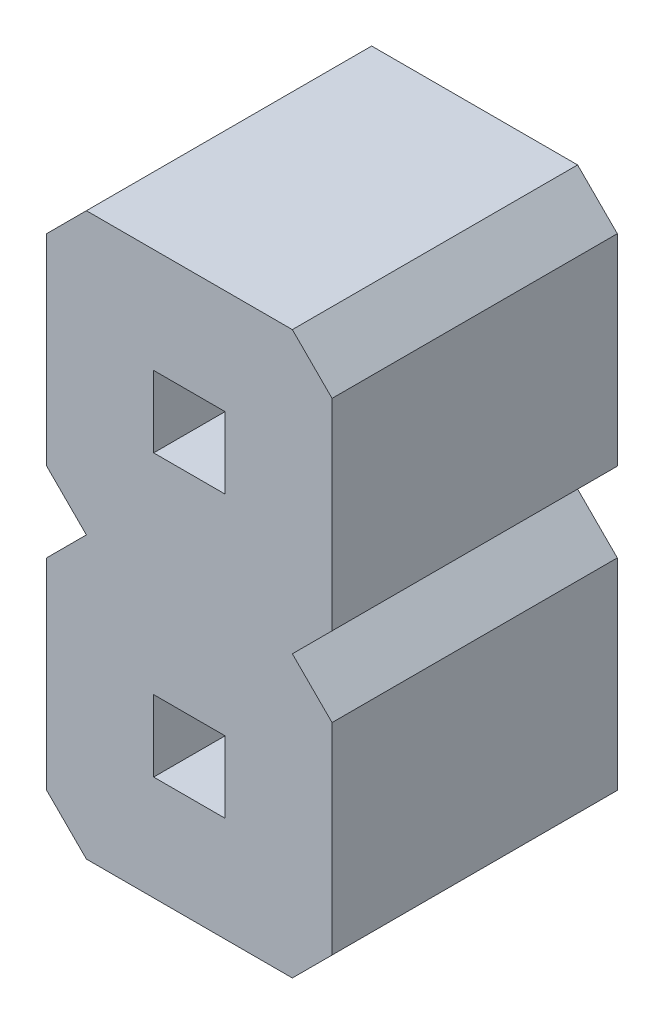
ISO-10303-21;
HEADER;
FILE_DESCRIPTION(('STEP AP214'),'2;1');
FILE_NAME('part.step','',(''),(''),'','','');
FILE_SCHEMA(('AUTOMOTIVE_DESIGN { 1 0 10303 214 1 1 1 1 }'));
ENDSEC;
DATA;
#1=APPLICATION_CONTEXT('core data for automotive mechanical design processes');
#2=APPLICATION_PROTOCOL_DEFINITION('international standard','automotive_design',2000,#1);
#3=PRODUCT_CONTEXT('',#1,'mechanical');
#4=PRODUCT('Part','Part','',(#3));
#5=PRODUCT_RELATED_PRODUCT_CATEGORY('part','',(#4));
#6=PRODUCT_DEFINITION_FORMATION('','',#4);
#7=PRODUCT_DEFINITION_CONTEXT('part definition',#1,'design');
#8=PRODUCT_DEFINITION('design','',#6,#7);
#9=PRODUCT_DEFINITION_SHAPE('','',#8);
#10=(LENGTH_UNIT() NAMED_UNIT(*) SI_UNIT(.MILLI.,.METRE.));
#11=(NAMED_UNIT(*) PLANE_ANGLE_UNIT() SI_UNIT($,.RADIAN.));
#12=(NAMED_UNIT(*) SI_UNIT($,.STERADIAN.) SOLID_ANGLE_UNIT());
#13=UNCERTAINTY_MEASURE_WITH_UNIT(LENGTH_MEASURE(1.E-05),#10,'distance_accuracy_value','');
#14=(GEOMETRIC_REPRESENTATION_CONTEXT(3) GLOBAL_UNCERTAINTY_ASSIGNED_CONTEXT((#13)) GLOBAL_UNIT_ASSIGNED_CONTEXT((#10,
#11,#12)) REPRESENTATION_CONTEXT('',''));
#15=CARTESIAN_POINT('',(0.,0.,0.));
#16=DIRECTION('',(0.,0.,1.));
#17=DIRECTION('',(1.,0.,0.));
#18=AXIS2_PLACEMENT_3D('',#15,#16,#17);
#19=CARTESIAN_POINT('',(0.,0.,2.54));
#20=DIRECTION('',(0.,0.,1.));
#21=DIRECTION('',(1.,0.,0.));
#22=AXIS2_PLACEMENT_3D('',#19,#20,#21);
#23=PLANE('',#22);
#24=DIRECTION('',(1.,0.,0.));
#25=VECTOR('',#24,1.);
#26=CARTESIAN_POINT('',(0.9525,-1.568,2.54));
#27=LINE('',#26,#25);
#28=CARTESIAN_POINT('',(0.9525,-1.568,2.54));
#29=VERTEX_POINT('',#28);
#30=CARTESIAN_POINT('',(1.5885,-1.568,2.54));
#31=VERTEX_POINT('',#30);
#32=EDGE_CURVE('E220',#29,#31,#27,.T.);
#33=ORIENTED_EDGE('',*,*,#32,.F.);
#34=DIRECTION('',(0.,-1.,0.));
#35=VECTOR('',#34,1.);
#36=CARTESIAN_POINT('',(0.9525,-0.932,2.54));
#37=LINE('',#36,#35);
#38=CARTESIAN_POINT('',(0.9525,-0.932,2.54));
#39=VERTEX_POINT('',#38);
#40=EDGE_CURVE('E218',#39,#29,#37,.T.);
#41=ORIENTED_EDGE('',*,*,#40,.F.);
#42=DIRECTION('',(-1.,0.,0.));
#43=VECTOR('',#42,1.);
#44=CARTESIAN_POINT('',(0.9525,-0.932,2.54));
#45=LINE('',#44,#43);
#46=CARTESIAN_POINT('',(1.5885,-0.932,2.54));
#47=VERTEX_POINT('',#46);
#48=EDGE_CURVE('E226',#47,#39,#45,.T.);
#49=ORIENTED_EDGE('',*,*,#48,.F.);
#50=DIRECTION('',(0.,1.,0.));
#51=VECTOR('',#50,1.);
#52=CARTESIAN_POINT('',(1.5885,-0.932,2.54));
#53=LINE('',#52,#51);
#54=EDGE_CURVE('E223',#31,#47,#53,.T.);
#55=ORIENTED_EDGE('',*,*,#54,.F.);
#56=EDGE_LOOP('',(#33,#41,#49,#55));
#57=FACE_BOUND('',#56,.T.);
#58=DIRECTION('',(-0.707106781186543,-0.707106781186552,0.));
#59=VECTOR('',#58,1.);
#60=CARTESIAN_POINT('',(0.,-0.353553390593276,2.54));
#61=LINE('',#60,#59);
#62=CARTESIAN_POINT('',(0.353553390593274,0.,2.54));
#63=VERTEX_POINT('',#62);
#64=CARTESIAN_POINT('',(0.,-0.353553390593276,2.54));
#65=VERTEX_POINT('',#64);
#66=EDGE_CURVE('E249',#63,#65,#61,.T.);
#67=ORIENTED_EDGE('',*,*,#66,.T.);
#68=DIRECTION('',(0.,-1.,0.));
#69=VECTOR('',#68,1.);
#70=CARTESIAN_POINT('',(0.,-0.353553390593276,2.54));
#71=LINE('',#70,#69);
#72=CARTESIAN_POINT('',(0.,-2.14644660940673,2.54));
#73=VERTEX_POINT('',#72);
#74=EDGE_CURVE('E252',#65,#73,#71,.T.);
#75=ORIENTED_EDGE('',*,*,#74,.T.);
#76=DIRECTION('',(0.707106781186551,-0.707106781186544,0.));
#77=VECTOR('',#76,1.);
#78=CARTESIAN_POINT('',(0.353553390593274,-2.5,2.54));
#79=LINE('',#78,#77);
#80=CARTESIAN_POINT('',(0.353553390593274,-2.5,2.54));
#81=VERTEX_POINT('',#80);
#82=EDGE_CURVE('E255',#73,#81,#79,.T.);
#83=ORIENTED_EDGE('',*,*,#82,.T.);
#84=DIRECTION('',(1.,0.,0.));
#85=VECTOR('',#84,1.);
#86=CARTESIAN_POINT('',(2.18744660940673,-2.50000000000001,2.54));
#87=LINE('',#86,#85);
#88=CARTESIAN_POINT('',(2.18744660940673,-2.50000000000001,2.54));
#89=VERTEX_POINT('',#88);
#90=EDGE_CURVE('E257',#81,#89,#87,.T.);
#91=ORIENTED_EDGE('',*,*,#90,.T.);
#92=DIRECTION('',(0.707106781186538,0.707106781186557,0.));
#93=VECTOR('',#92,1.);
#94=CARTESIAN_POINT('',(2.54100000000001,-2.14644660940673,2.54));
#95=LINE('',#94,#93);
#96=CARTESIAN_POINT('',(2.54100000000001,-2.14644660940673,2.54));
#97=VERTEX_POINT('',#96);
#98=EDGE_CURVE('E259',#89,#97,#95,.T.);
#99=ORIENTED_EDGE('',*,*,#98,.T.);
#100=DIRECTION('',(0.,1.,0.));
#101=VECTOR('',#100,1.);
#102=CARTESIAN_POINT('',(2.541,-0.353553390593266,2.54));
#103=LINE('',#102,#101);
#104=CARTESIAN_POINT('',(2.541,-0.353553390593266,2.54));
#105=VERTEX_POINT('',#104);
#106=EDGE_CURVE('E261',#97,#105,#103,.T.);
#107=ORIENTED_EDGE('',*,*,#106,.T.);
#108=DIRECTION('',(-0.707106781186556,0.707106781186539,0.));
#109=VECTOR('',#108,1.);
#110=CARTESIAN_POINT('',(2.18744660940671,0.,2.54));
#111=LINE('',#110,#109);
#112=CARTESIAN_POINT('',(2.18744660940671,0.,2.54));
#113=VERTEX_POINT('',#112);
#114=EDGE_CURVE('E263',#105,#113,#111,.T.);
#115=ORIENTED_EDGE('',*,*,#114,.T.);
#116=DIRECTION('',(0.707106781186562,0.707106781186533,0.));
#117=VECTOR('',#116,1.);
#118=CARTESIAN_POINT('',(2.54099999999999,0.353553390593273,2.54));
#119=LINE('',#118,#117);
#120=CARTESIAN_POINT('',(2.54099999999999,0.353553390593273,2.54));
#121=VERTEX_POINT('',#120);
#122=EDGE_CURVE('E265',#113,#121,#119,.T.);
#123=ORIENTED_EDGE('',*,*,#122,.T.);
#124=DIRECTION('',(0.,1.,0.));
#125=VECTOR('',#124,1.);
#126=CARTESIAN_POINT('',(2.54099999999999,2.14644660940673,2.54));
#127=LINE('',#126,#125);
#128=CARTESIAN_POINT('',(2.54099999999999,2.14644660940673,2.54));
#129=VERTEX_POINT('',#128);
#130=EDGE_CURVE('E267',#121,#129,#127,.T.);
#131=ORIENTED_EDGE('',*,*,#130,.T.);
#132=DIRECTION('',(-0.707106781186556,0.707106781186539,0.));
#133=VECTOR('',#132,1.);
#134=CARTESIAN_POINT('',(2.18744660940672,2.5,2.54));
#135=LINE('',#134,#133);
#136=CARTESIAN_POINT('',(2.18744660940672,2.5,2.54));
#137=VERTEX_POINT('',#136);
#138=EDGE_CURVE('E269',#129,#137,#135,.T.);
#139=ORIENTED_EDGE('',*,*,#138,.T.);
#140=DIRECTION('',(-1.,0.,0.));
#141=VECTOR('',#140,1.);
#142=CARTESIAN_POINT('',(0.353553390593263,2.5,2.54));
#143=LINE('',#142,#141);
#144=CARTESIAN_POINT('',(0.353553390593263,2.5,2.54));
#145=VERTEX_POINT('',#144);
#146=EDGE_CURVE('E271',#137,#145,#143,.T.);
#147=ORIENTED_EDGE('',*,*,#146,.T.);
#148=DIRECTION('',(-0.707106781186541,-0.707106781186554,0.));
#149=VECTOR('',#148,1.);
#150=CARTESIAN_POINT('',(0.,2.14644660940672,2.54));
#151=LINE('',#150,#149);
#152=CARTESIAN_POINT('',(0.,2.14644660940672,2.54));
#153=VERTEX_POINT('',#152);
#154=EDGE_CURVE('E273',#145,#153,#151,.T.);
#155=ORIENTED_EDGE('',*,*,#154,.T.);
#156=DIRECTION('',(0.,-1.,0.));
#157=VECTOR('',#156,1.);
#158=CARTESIAN_POINT('',(0.,2.14644660940672,2.54));
#159=LINE('',#158,#157);
#160=CARTESIAN_POINT('',(0.,0.35355339059327,2.54));
#161=VERTEX_POINT('',#160);
#162=EDGE_CURVE('E275',#153,#161,#159,.T.);
#163=ORIENTED_EDGE('',*,*,#162,.T.);
#164=DIRECTION('',(0.70710678118656,-0.707106781186535,0.));
#165=VECTOR('',#164,1.);
#166=CARTESIAN_POINT('',(0.353553390593274,0.,2.54));
#167=LINE('',#166,#165);
#168=EDGE_CURVE('E277',#161,#63,#167,.T.);
#169=ORIENTED_EDGE('',*,*,#168,.T.);
#170=EDGE_LOOP('',(#67,#75,#83,#91,#99,#107,#115,#123,#131,#139,#147,#155,#163,#169));
#171=FACE_BOUND('',#170,.T.);
#172=DIRECTION('',(1.,0.,0.));
#173=VECTOR('',#172,1.);
#174=CARTESIAN_POINT('',(0.952499999999992,0.932,2.54));
#175=LINE('',#174,#173);
#176=CARTESIAN_POINT('',(0.952499999999992,0.932,2.54));
#177=VERTEX_POINT('',#176);
#178=CARTESIAN_POINT('',(1.58849999999999,0.932,2.54));
#179=VERTEX_POINT('',#178);
#180=EDGE_CURVE('E190',#177,#179,#175,.T.);
#181=ORIENTED_EDGE('',*,*,#180,.F.);
#182=DIRECTION('',(0.,-1.,0.));
#183=VECTOR('',#182,1.);
#184=CARTESIAN_POINT('',(0.952499999999991,1.568,2.54));
#185=LINE('',#184,#183);
#186=CARTESIAN_POINT('',(0.952499999999991,1.568,2.54));
#187=VERTEX_POINT('',#186);
#188=EDGE_CURVE('E182',#187,#177,#185,.T.);
#189=ORIENTED_EDGE('',*,*,#188,.F.);
#190=DIRECTION('',(-1.,0.,0.));
#191=VECTOR('',#190,1.);
#192=CARTESIAN_POINT('',(0.952499999999991,1.568,2.54));
#193=LINE('',#192,#191);
#194=CARTESIAN_POINT('',(1.58849999999999,1.568,2.54));
#195=VERTEX_POINT('',#194);
#196=EDGE_CURVE('E204',#195,#187,#193,.T.);
#197=ORIENTED_EDGE('',*,*,#196,.F.);
#198=DIRECTION('',(0.,1.,0.));
#199=VECTOR('',#198,1.);
#200=CARTESIAN_POINT('',(1.58849999999999,1.568,2.54));
#201=LINE('',#200,#199);
#202=EDGE_CURVE('E202',#179,#195,#201,.T.);
#203=ORIENTED_EDGE('',*,*,#202,.F.);
#204=EDGE_LOOP('',(#181,#189,#197,#203));
#205=FACE_BOUND('',#204,.T.);
#206=ADVANCED_FACE('F33',(#57,#171,#205),#23,.T.);
#207=CARTESIAN_POINT('',(0.,0.,0.));
#208=DIRECTION('',(0.,0.,1.));
#209=DIRECTION('',(1.,0.,0.));
#210=AXIS2_PLACEMENT_3D('',#207,#208,#209);
#211=PLANE('',#210);
#212=DIRECTION('',(0.,-1.,0.));
#213=VECTOR('',#212,1.);
#214=CARTESIAN_POINT('',(0.9525,-0.932,0.));
#215=LINE('',#214,#213);
#216=CARTESIAN_POINT('',(0.9525,-0.932,0.));
#217=VERTEX_POINT('',#216);
#218=CARTESIAN_POINT('',(0.9525,-1.568,0.));
#219=VERTEX_POINT('',#218);
#220=EDGE_CURVE('E198',#217,#219,#215,.T.);
#221=ORIENTED_EDGE('',*,*,#220,.T.);
#222=DIRECTION('',(1.,0.,0.));
#223=VECTOR('',#222,1.);
#224=CARTESIAN_POINT('',(0.9525,-1.568,0.));
#225=LINE('',#224,#223);
#226=CARTESIAN_POINT('',(1.5885,-1.568,0.));
#227=VERTEX_POINT('',#226);
#228=EDGE_CURVE('E231',#219,#227,#225,.T.);
#229=ORIENTED_EDGE('',*,*,#228,.T.);
#230=DIRECTION('',(0.,1.,0.));
#231=VECTOR('',#230,1.);
#232=CARTESIAN_POINT('',(1.5885,-0.932,0.));
#233=LINE('',#232,#231);
#234=CARTESIAN_POINT('',(1.5885,-0.932,0.));
#235=VERTEX_POINT('',#234);
#236=EDGE_CURVE('E234',#227,#235,#233,.T.);
#237=ORIENTED_EDGE('',*,*,#236,.T.);
#238=DIRECTION('',(-1.,0.,0.));
#239=VECTOR('',#238,1.);
#240=CARTESIAN_POINT('',(0.9525,-0.932,0.));
#241=LINE('',#240,#239);
#242=EDGE_CURVE('E221',#235,#217,#241,.T.);
#243=ORIENTED_EDGE('',*,*,#242,.T.);
#244=EDGE_LOOP('',(#221,#229,#237,#243));
#245=FACE_BOUND('',#244,.T.);
#246=DIRECTION('',(-0.707106781186543,-0.707106781186552,0.));
#247=VECTOR('',#246,1.);
#248=CARTESIAN_POINT('',(0.,-0.353553390593276,0.));
#249=LINE('',#248,#247);
#250=CARTESIAN_POINT('',(0.353553390593274,0.,0.));
#251=VERTEX_POINT('',#250);
#252=CARTESIAN_POINT('',(0.,-0.353553390593276,0.));
#253=VERTEX_POINT('',#252);
#254=EDGE_CURVE('E248',#251,#253,#249,.T.);
#255=ORIENTED_EDGE('',*,*,#254,.F.);
#256=DIRECTION('',(0.70710678118656,-0.707106781186535,0.));
#257=VECTOR('',#256,1.);
#258=CARTESIAN_POINT('',(0.353553390593274,0.,0.));
#259=LINE('',#258,#257);
#260=CARTESIAN_POINT('',(0.,0.35355339059327,0.));
#261=VERTEX_POINT('',#260);
#262=EDGE_CURVE('E253',#261,#251,#259,.T.);
#263=ORIENTED_EDGE('',*,*,#262,.F.);
#264=DIRECTION('',(0.,-1.,0.));
#265=VECTOR('',#264,1.);
#266=CARTESIAN_POINT('',(0.,2.14644660940672,0.));
#267=LINE('',#266,#265);
#268=CARTESIAN_POINT('',(0.,2.14644660940672,0.));
#269=VERTEX_POINT('',#268);
#270=EDGE_CURVE('E304',#269,#261,#267,.T.);
#271=ORIENTED_EDGE('',*,*,#270,.F.);
#272=DIRECTION('',(-0.707106781186541,-0.707106781186554,0.));
#273=VECTOR('',#272,1.);
#274=CARTESIAN_POINT('',(0.,2.14644660940672,0.));
#275=LINE('',#274,#273);
#276=CARTESIAN_POINT('',(0.353553390593263,2.5,0.));
#277=VERTEX_POINT('',#276);
#278=EDGE_CURVE('E302',#277,#269,#275,.T.);
#279=ORIENTED_EDGE('',*,*,#278,.F.);
#280=DIRECTION('',(-1.,0.,0.));
#281=VECTOR('',#280,1.);
#282=CARTESIAN_POINT('',(0.353553390593263,2.5,0.));
#283=LINE('',#282,#281);
#284=CARTESIAN_POINT('',(2.18744660940672,2.5,0.));
#285=VERTEX_POINT('',#284);
#286=EDGE_CURVE('E300',#285,#277,#283,.T.);
#287=ORIENTED_EDGE('',*,*,#286,.F.);
#288=DIRECTION('',(-0.707106781186556,0.707106781186539,0.));
#289=VECTOR('',#288,1.);
#290=CARTESIAN_POINT('',(2.18744660940672,2.5,0.));
#291=LINE('',#290,#289);
#292=CARTESIAN_POINT('',(2.54099999999999,2.14644660940673,0.));
#293=VERTEX_POINT('',#292);
#294=EDGE_CURVE('E298',#293,#285,#291,.T.);
#295=ORIENTED_EDGE('',*,*,#294,.F.);
#296=DIRECTION('',(0.,1.,0.));
#297=VECTOR('',#296,1.);
#298=CARTESIAN_POINT('',(2.54099999999999,2.14644660940673,0.));
#299=LINE('',#298,#297);
#300=CARTESIAN_POINT('',(2.54099999999999,0.353553390593273,0.));
#301=VERTEX_POINT('',#300);
#302=EDGE_CURVE('E296',#301,#293,#299,.T.);
#303=ORIENTED_EDGE('',*,*,#302,.F.);
#304=DIRECTION('',(0.707106781186562,0.707106781186533,0.));
#305=VECTOR('',#304,1.);
#306=CARTESIAN_POINT('',(2.54099999999999,0.353553390593273,0.));
#307=LINE('',#306,#305);
#308=CARTESIAN_POINT('',(2.18744660940671,0.,0.));
#309=VERTEX_POINT('',#308);
#310=EDGE_CURVE('E294',#309,#301,#307,.T.);
#311=ORIENTED_EDGE('',*,*,#310,.F.);
#312=DIRECTION('',(-0.707106781186556,0.707106781186539,0.));
#313=VECTOR('',#312,1.);
#314=CARTESIAN_POINT('',(2.18744660940671,0.,0.));
#315=LINE('',#314,#313);
#316=CARTESIAN_POINT('',(2.541,-0.353553390593266,0.));
#317=VERTEX_POINT('',#316);
#318=EDGE_CURVE('E292',#317,#309,#315,.T.);
#319=ORIENTED_EDGE('',*,*,#318,.F.);
#320=DIRECTION('',(0.,1.,0.));
#321=VECTOR('',#320,1.);
#322=CARTESIAN_POINT('',(2.541,-0.353553390593266,0.));
#323=LINE('',#322,#321);
#324=CARTESIAN_POINT('',(2.54100000000001,-2.14644660940673,0.));
#325=VERTEX_POINT('',#324);
#326=EDGE_CURVE('E290',#325,#317,#323,.T.);
#327=ORIENTED_EDGE('',*,*,#326,.F.);
#328=DIRECTION('',(0.707106781186538,0.707106781186557,0.));
#329=VECTOR('',#328,1.);
#330=CARTESIAN_POINT('',(2.54100000000001,-2.14644660940673,0.));
#331=LINE('',#330,#329);
#332=CARTESIAN_POINT('',(2.18744660940673,-2.50000000000001,0.));
#333=VERTEX_POINT('',#332);
#334=EDGE_CURVE('E288',#333,#325,#331,.T.);
#335=ORIENTED_EDGE('',*,*,#334,.F.);
#336=DIRECTION('',(1.,0.,0.));
#337=VECTOR('',#336,1.);
#338=CARTESIAN_POINT('',(2.18744660940673,-2.50000000000001,0.));
#339=LINE('',#338,#337);
#340=CARTESIAN_POINT('',(0.353553390593274,-2.5,0.));
#341=VERTEX_POINT('',#340);
#342=EDGE_CURVE('E286',#341,#333,#339,.T.);
#343=ORIENTED_EDGE('',*,*,#342,.F.);
#344=DIRECTION('',(0.707106781186551,-0.707106781186544,0.));
#345=VECTOR('',#344,1.);
#346=CARTESIAN_POINT('',(0.353553390593274,-2.5,0.));
#347=LINE('',#346,#345);
#348=CARTESIAN_POINT('',(0.,-2.14644660940673,0.));
#349=VERTEX_POINT('',#348);
#350=EDGE_CURVE('E284',#349,#341,#347,.T.);
#351=ORIENTED_EDGE('',*,*,#350,.F.);
#352=DIRECTION('',(0.,-1.,0.));
#353=VECTOR('',#352,1.);
#354=CARTESIAN_POINT('',(0.,-0.353553390593276,0.));
#355=LINE('',#354,#353);
#356=EDGE_CURVE('E282',#253,#349,#355,.T.);
#357=ORIENTED_EDGE('',*,*,#356,.F.);
#358=EDGE_LOOP('',(#255,#263,#271,#279,#287,#295,#303,#311,#319,#327,#335,#343,#351,#357));
#359=FACE_BOUND('',#358,.T.);
#360=DIRECTION('',(0.,-1.,0.));
#361=VECTOR('',#360,1.);
#362=CARTESIAN_POINT('',(0.952499999999991,1.568,0.));
#363=LINE('',#362,#361);
#364=CARTESIAN_POINT('',(0.952499999999991,1.568,0.));
#365=VERTEX_POINT('',#364);
#366=CARTESIAN_POINT('',(0.952499999999992,0.932,0.));
#367=VERTEX_POINT('',#366);
#368=EDGE_CURVE('E56',#365,#367,#363,.T.);
#369=ORIENTED_EDGE('',*,*,#368,.T.);
#370=DIRECTION('',(1.,0.,0.));
#371=VECTOR('',#370,1.);
#372=CARTESIAN_POINT('',(0.952499999999992,0.932,0.));
#373=LINE('',#372,#371);
#374=CARTESIAN_POINT('',(1.58849999999999,0.932,0.));
#375=VERTEX_POINT('',#374);
#376=EDGE_CURVE('E197',#367,#375,#373,.T.);
#377=ORIENTED_EDGE('',*,*,#376,.T.);
#378=DIRECTION('',(0.,1.,0.));
#379=VECTOR('',#378,1.);
#380=CARTESIAN_POINT('',(1.58849999999999,1.568,0.));
#381=LINE('',#380,#379);
#382=CARTESIAN_POINT('',(1.58849999999999,1.568,0.));
#383=VERTEX_POINT('',#382);
#384=EDGE_CURVE('E210',#375,#383,#381,.T.);
#385=ORIENTED_EDGE('',*,*,#384,.T.);
#386=DIRECTION('',(-1.,0.,0.));
#387=VECTOR('',#386,1.);
#388=CARTESIAN_POINT('',(0.952499999999991,1.568,0.));
#389=LINE('',#388,#387);
#390=EDGE_CURVE('E191',#383,#365,#389,.T.);
#391=ORIENTED_EDGE('',*,*,#390,.T.);
#392=EDGE_LOOP('',(#369,#377,#385,#391));
#393=FACE_BOUND('',#392,.T.);
#394=ADVANCED_FACE('F352',(#245,#359,#393),#211,.F.);
#395=CARTESIAN_POINT('',(0.,-0.353553390593276,2.54));
#396=DIRECTION('',(0.707106781186552,-0.707106781186543,0.));
#397=DIRECTION('',(0.707106781186543,0.707106781186552,0.));
#398=AXIS2_PLACEMENT_3D('',#395,#396,#397);
#399=PLANE('',#398);
#400=ORIENTED_EDGE('',*,*,#254,.T.);
#401=DIRECTION('',(0.,0.,-1.));
#402=VECTOR('',#401,1.);
#403=CARTESIAN_POINT('',(0.,-0.353553390593276,2.54));
#404=LINE('',#403,#402);
#405=EDGE_CURVE('E11',#65,#253,#404,.T.);
#406=ORIENTED_EDGE('',*,*,#405,.F.);
#407=ORIENTED_EDGE('',*,*,#66,.F.);
#408=DIRECTION('',(0.,0.,-1.));
#409=VECTOR('',#408,1.);
#410=CARTESIAN_POINT('',(0.353553390593274,0.,2.54));
#411=LINE('',#410,#409);
#412=EDGE_CURVE('E279',#63,#251,#411,.T.);
#413=ORIENTED_EDGE('',*,*,#412,.T.);
#414=EDGE_LOOP('',(#400,#406,#407,#413));
#415=FACE_BOUND('',#414,.T.);
#416=ADVANCED_FACE('F35',(#415),#399,.F.);
#417=CARTESIAN_POINT('',(0.,-0.353553390593276,2.54));
#418=DIRECTION('',(1.,0.,0.));
#419=DIRECTION('',(0.,1.,0.));
#420=AXIS2_PLACEMENT_3D('',#417,#418,#419);
#421=PLANE('',#420);
#422=ORIENTED_EDGE('',*,*,#356,.T.);
#423=DIRECTION('',(0.,0.,-1.));
#424=VECTOR('',#423,1.);
#425=CARTESIAN_POINT('',(0.,-2.14644660940673,2.54));
#426=LINE('',#425,#424);
#427=EDGE_CURVE('E41',#73,#349,#426,.T.);
#428=ORIENTED_EDGE('',*,*,#427,.F.);
#429=ORIENTED_EDGE('',*,*,#74,.F.);
#430=ORIENTED_EDGE('',*,*,#405,.T.);
#431=EDGE_LOOP('',(#422,#428,#429,#430));
#432=FACE_BOUND('',#431,.T.);
#433=ADVANCED_FACE('F369',(#432),#421,.F.);
#434=CARTESIAN_POINT('',(0.353553390593274,-2.5,2.54));
#435=DIRECTION('',(0.707106781186544,0.707106781186551,0.));
#436=DIRECTION('',(-0.707106781186551,0.707106781186544,0.));
#437=AXIS2_PLACEMENT_3D('',#434,#435,#436);
#438=PLANE('',#437);
#439=ORIENTED_EDGE('',*,*,#350,.T.);
#440=DIRECTION('',(0.,0.,-1.));
#441=VECTOR('',#440,1.);
#442=CARTESIAN_POINT('',(0.353553390593274,-2.5,2.54));
#443=LINE('',#442,#441);
#444=EDGE_CURVE('E339',#81,#341,#443,.T.);
#445=ORIENTED_EDGE('',*,*,#444,.F.);
#446=ORIENTED_EDGE('',*,*,#82,.F.);
#447=ORIENTED_EDGE('',*,*,#427,.T.);
#448=EDGE_LOOP('',(#439,#445,#446,#447));
#449=FACE_BOUND('',#448,.T.);
#450=ADVANCED_FACE('F346',(#449),#438,.F.);
#451=CARTESIAN_POINT('',(2.18744660940673,-2.50000000000001,2.54));
#452=DIRECTION('',(0.,1.,0.));
#453=DIRECTION('',(-1.,0.,0.));
#454=AXIS2_PLACEMENT_3D('',#451,#452,#453);
#455=PLANE('',#454);
#456=ORIENTED_EDGE('',*,*,#342,.T.);
#457=DIRECTION('',(0.,0.,-1.));
#458=VECTOR('',#457,1.);
#459=CARTESIAN_POINT('',(2.18744660940673,-2.50000000000001,2.54));
#460=LINE('',#459,#458);
#461=EDGE_CURVE('E336',#89,#333,#460,.T.);
#462=ORIENTED_EDGE('',*,*,#461,.F.);
#463=ORIENTED_EDGE('',*,*,#90,.F.);
#464=ORIENTED_EDGE('',*,*,#444,.T.);
#465=EDGE_LOOP('',(#456,#462,#463,#464));
#466=FACE_BOUND('',#465,.T.);
#467=ADVANCED_FACE('F358',(#466),#455,.F.);
#468=CARTESIAN_POINT('',(2.54100000000001,-2.14644660940673,2.54));
#469=DIRECTION('',(-0.707106781186557,0.707106781186538,0.));
#470=DIRECTION('',(-0.707106781186538,-0.707106781186557,0.));
#471=AXIS2_PLACEMENT_3D('',#468,#469,#470);
#472=PLANE('',#471);
#473=ORIENTED_EDGE('',*,*,#334,.T.);
#474=DIRECTION('',(0.,0.,-1.));
#475=VECTOR('',#474,1.);
#476=CARTESIAN_POINT('',(2.54100000000001,-2.14644660940673,2.54));
#477=LINE('',#476,#475);
#478=EDGE_CURVE('E333',#97,#325,#477,.T.);
#479=ORIENTED_EDGE('',*,*,#478,.F.);
#480=ORIENTED_EDGE('',*,*,#98,.F.);
#481=ORIENTED_EDGE('',*,*,#461,.T.);
#482=EDGE_LOOP('',(#473,#479,#480,#481));
#483=FACE_BOUND('',#482,.T.);
#484=ADVANCED_FACE('F362',(#483),#472,.F.);
#485=CARTESIAN_POINT('',(2.541,-0.353553390593266,2.54));
#486=DIRECTION('',(-1.,0.,0.));
#487=DIRECTION('',(0.,-1.,0.));
#488=AXIS2_PLACEMENT_3D('',#485,#486,#487);
#489=PLANE('',#488);
#490=ORIENTED_EDGE('',*,*,#326,.T.);
#491=DIRECTION('',(0.,0.,-1.));
#492=VECTOR('',#491,1.);
#493=CARTESIAN_POINT('',(2.541,-0.353553390593266,2.54));
#494=LINE('',#493,#492);
#495=EDGE_CURVE('E330',#105,#317,#494,.T.);
#496=ORIENTED_EDGE('',*,*,#495,.F.);
#497=ORIENTED_EDGE('',*,*,#106,.F.);
#498=ORIENTED_EDGE('',*,*,#478,.T.);
#499=EDGE_LOOP('',(#490,#496,#497,#498));
#500=FACE_BOUND('',#499,.T.);
#501=ADVANCED_FACE('F412',(#500),#489,.F.);
#502=CARTESIAN_POINT('',(2.18744660940671,0.,2.54));
#503=DIRECTION('',(-0.707106781186539,-0.707106781186556,0.));
#504=DIRECTION('',(0.707106781186556,-0.707106781186539,0.));
#505=AXIS2_PLACEMENT_3D('',#502,#503,#504);
#506=PLANE('',#505);
#507=ORIENTED_EDGE('',*,*,#318,.T.);
#508=DIRECTION('',(0.,0.,-1.));
#509=VECTOR('',#508,1.);
#510=CARTESIAN_POINT('',(2.18744660940671,0.,2.54));
#511=LINE('',#510,#509);
#512=EDGE_CURVE('E327',#113,#309,#511,.T.);
#513=ORIENTED_EDGE('',*,*,#512,.F.);
#514=ORIENTED_EDGE('',*,*,#114,.F.);
#515=ORIENTED_EDGE('',*,*,#495,.T.);
#516=EDGE_LOOP('',(#507,#513,#514,#515));
#517=FACE_BOUND('',#516,.T.);
#518=ADVANCED_FACE('F410',(#517),#506,.F.);
#519=CARTESIAN_POINT('',(2.54099999999999,0.353553390593273,2.54));
#520=DIRECTION('',(-0.707106781186533,0.707106781186562,0.));
#521=DIRECTION('',(-0.707106781186562,-0.707106781186533,0.));
#522=AXIS2_PLACEMENT_3D('',#519,#520,#521);
#523=PLANE('',#522);
#524=ORIENTED_EDGE('',*,*,#310,.T.);
#525=DIRECTION('',(0.,0.,-1.));
#526=VECTOR('',#525,1.);
#527=CARTESIAN_POINT('',(2.54099999999999,0.353553390593273,2.54));
#528=LINE('',#527,#526);
#529=EDGE_CURVE('E324',#121,#301,#528,.T.);
#530=ORIENTED_EDGE('',*,*,#529,.F.);
#531=ORIENTED_EDGE('',*,*,#122,.F.);
#532=ORIENTED_EDGE('',*,*,#512,.T.);
#533=EDGE_LOOP('',(#524,#530,#531,#532));
#534=FACE_BOUND('',#533,.T.);
#535=ADVANCED_FACE('F405',(#534),#523,.F.);
#536=CARTESIAN_POINT('',(2.54099999999999,2.14644660940673,2.54));
#537=DIRECTION('',(-1.,0.,0.));
#538=DIRECTION('',(0.,-1.,0.));
#539=AXIS2_PLACEMENT_3D('',#536,#537,#538);
#540=PLANE('',#539);
#541=ORIENTED_EDGE('',*,*,#302,.T.);
#542=DIRECTION('',(0.,0.,-1.));
#543=VECTOR('',#542,1.);
#544=CARTESIAN_POINT('',(2.54099999999999,2.14644660940673,2.54));
#545=LINE('',#544,#543);
#546=EDGE_CURVE('E321',#129,#293,#545,.T.);
#547=ORIENTED_EDGE('',*,*,#546,.F.);
#548=ORIENTED_EDGE('',*,*,#130,.F.);
#549=ORIENTED_EDGE('',*,*,#529,.T.);
#550=EDGE_LOOP('',(#541,#547,#548,#549));
#551=FACE_BOUND('',#550,.T.);
#552=ADVANCED_FACE('F400',(#551),#540,.F.);
#553=CARTESIAN_POINT('',(2.18744660940672,2.5,2.54));
#554=DIRECTION('',(-0.707106781186539,-0.707106781186556,0.));
#555=DIRECTION('',(0.707106781186556,-0.707106781186539,0.));
#556=AXIS2_PLACEMENT_3D('',#553,#554,#555);
#557=PLANE('',#556);
#558=ORIENTED_EDGE('',*,*,#294,.T.);
#559=DIRECTION('',(0.,0.,-1.));
#560=VECTOR('',#559,1.);
#561=CARTESIAN_POINT('',(2.18744660940672,2.5,2.54));
#562=LINE('',#561,#560);
#563=EDGE_CURVE('E318',#137,#285,#562,.T.);
#564=ORIENTED_EDGE('',*,*,#563,.F.);
#565=ORIENTED_EDGE('',*,*,#138,.F.);
#566=ORIENTED_EDGE('',*,*,#546,.T.);
#567=EDGE_LOOP('',(#558,#564,#565,#566));
#568=FACE_BOUND('',#567,.T.);
#569=ADVANCED_FACE('F396',(#568),#557,.F.);
#570=CARTESIAN_POINT('',(0.353553390593263,2.5,2.54));
#571=DIRECTION('',(0.,-1.,0.));
#572=DIRECTION('',(0.,0.,-1.));
#573=AXIS2_PLACEMENT_3D('',#570,#571,#572);
#574=PLANE('',#573);
#575=ORIENTED_EDGE('',*,*,#286,.T.);
#576=DIRECTION('',(0.,0.,-1.));
#577=VECTOR('',#576,1.);
#578=CARTESIAN_POINT('',(0.353553390593263,2.5,2.54));
#579=LINE('',#578,#577);
#580=EDGE_CURVE('E315',#145,#277,#579,.T.);
#581=ORIENTED_EDGE('',*,*,#580,.F.);
#582=ORIENTED_EDGE('',*,*,#146,.F.);
#583=ORIENTED_EDGE('',*,*,#563,.T.);
#584=EDGE_LOOP('',(#575,#581,#582,#583));
#585=FACE_BOUND('',#584,.T.);
#586=ADVANCED_FACE('F391',(#585),#574,.F.);
#587=CARTESIAN_POINT('',(0.,2.14644660940672,2.54));
#588=DIRECTION('',(0.707106781186554,-0.707106781186541,0.));
#589=DIRECTION('',(0.707106781186541,0.707106781186554,0.));
#590=AXIS2_PLACEMENT_3D('',#587,#588,#589);
#591=PLANE('',#590);
#592=ORIENTED_EDGE('',*,*,#278,.T.);
#593=DIRECTION('',(0.,0.,-1.));
#594=VECTOR('',#593,1.);
#595=CARTESIAN_POINT('',(0.,2.14644660940672,2.54));
#596=LINE('',#595,#594);
#597=EDGE_CURVE('E312',#153,#269,#596,.T.);
#598=ORIENTED_EDGE('',*,*,#597,.F.);
#599=ORIENTED_EDGE('',*,*,#154,.F.);
#600=ORIENTED_EDGE('',*,*,#580,.T.);
#601=EDGE_LOOP('',(#592,#598,#599,#600));
#602=FACE_BOUND('',#601,.T.);
#603=ADVANCED_FACE('F385',(#602),#591,.F.);
#604=CARTESIAN_POINT('',(0.,2.14644660940672,2.54));
#605=DIRECTION('',(1.,0.,0.));
#606=DIRECTION('',(0.,1.,0.));
#607=AXIS2_PLACEMENT_3D('',#604,#605,#606);
#608=PLANE('',#607);
#609=ORIENTED_EDGE('',*,*,#270,.T.);
#610=DIRECTION('',(0.,0.,-1.));
#611=VECTOR('',#610,1.);
#612=CARTESIAN_POINT('',(0.,0.35355339059327,2.54));
#613=LINE('',#612,#611);
#614=EDGE_CURVE('E309',#161,#261,#613,.T.);
#615=ORIENTED_EDGE('',*,*,#614,.F.);
#616=ORIENTED_EDGE('',*,*,#162,.F.);
#617=ORIENTED_EDGE('',*,*,#597,.T.);
#618=EDGE_LOOP('',(#609,#615,#616,#617));
#619=FACE_BOUND('',#618,.T.);
#620=ADVANCED_FACE('F381',(#619),#608,.F.);
#621=CARTESIAN_POINT('',(0.353553390593274,0.,2.54));
#622=DIRECTION('',(0.707106781186535,0.70710678118656,0.));
#623=DIRECTION('',(-0.70710678118656,0.707106781186535,0.));
#624=AXIS2_PLACEMENT_3D('',#621,#622,#623);
#625=PLANE('',#624);
#626=ORIENTED_EDGE('',*,*,#262,.T.);
#627=ORIENTED_EDGE('',*,*,#412,.F.);
#628=ORIENTED_EDGE('',*,*,#168,.F.);
#629=ORIENTED_EDGE('',*,*,#614,.T.);
#630=EDGE_LOOP('',(#626,#627,#628,#629));
#631=FACE_BOUND('',#630,.T.);
#632=ADVANCED_FACE('F376',(#631),#625,.F.);
#633=CARTESIAN_POINT('',(0.9525,-0.932,2.54));
#634=DIRECTION('',(1.,0.,0.));
#635=DIRECTION('',(0.,1.,0.));
#636=AXIS2_PLACEMENT_3D('',#633,#634,#635);
#637=PLANE('',#636);
#638=ORIENTED_EDGE('',*,*,#220,.F.);
#639=DIRECTION('',(0.,0.,-1.));
#640=VECTOR('',#639,1.);
#641=CARTESIAN_POINT('',(0.9525,-0.932,2.54));
#642=LINE('',#641,#640);
#643=EDGE_CURVE('E228',#39,#217,#642,.T.);
#644=ORIENTED_EDGE('',*,*,#643,.F.);
#645=ORIENTED_EDGE('',*,*,#40,.T.);
#646=DIRECTION('',(0.,0.,-1.));
#647=VECTOR('',#646,1.);
#648=CARTESIAN_POINT('',(0.9525,-1.568,2.54));
#649=LINE('',#648,#647);
#650=EDGE_CURVE('E245',#29,#219,#649,.T.);
#651=ORIENTED_EDGE('',*,*,#650,.T.);
#652=EDGE_LOOP('',(#638,#644,#645,#651));
#653=FACE_BOUND('',#652,.T.);
#654=ADVANCED_FACE('F431',(#653),#637,.T.);
#655=CARTESIAN_POINT('',(0.9525,-1.568,2.54));
#656=DIRECTION('',(0.,1.,0.));
#657=DIRECTION('',(0.,0.,1.));
#658=AXIS2_PLACEMENT_3D('',#655,#656,#657);
#659=PLANE('',#658);
#660=ORIENTED_EDGE('',*,*,#228,.F.);
#661=ORIENTED_EDGE('',*,*,#650,.F.);
#662=ORIENTED_EDGE('',*,*,#32,.T.);
#663=DIRECTION('',(0.,0.,-1.));
#664=VECTOR('',#663,1.);
#665=CARTESIAN_POINT('',(1.5885,-1.568,2.54));
#666=LINE('',#665,#664);
#667=EDGE_CURVE('E243',#31,#227,#666,.T.);
#668=ORIENTED_EDGE('',*,*,#667,.T.);
#669=EDGE_LOOP('',(#660,#661,#662,#668));
#670=FACE_BOUND('',#669,.T.);
#671=ADVANCED_FACE('F481',(#670),#659,.T.);
#672=CARTESIAN_POINT('',(1.5885,-0.932,2.54));
#673=DIRECTION('',(-1.,0.,0.));
#674=DIRECTION('',(0.,-1.,0.));
#675=AXIS2_PLACEMENT_3D('',#672,#673,#674);
#676=PLANE('',#675);
#677=ORIENTED_EDGE('',*,*,#236,.F.);
#678=ORIENTED_EDGE('',*,*,#667,.F.);
#679=ORIENTED_EDGE('',*,*,#54,.T.);
#680=DIRECTION('',(0.,0.,-1.));
#681=VECTOR('',#680,1.);
#682=CARTESIAN_POINT('',(1.5885,-0.932,2.54));
#683=LINE('',#682,#681);
#684=EDGE_CURVE('E241',#47,#235,#683,.T.);
#685=ORIENTED_EDGE('',*,*,#684,.T.);
#686=EDGE_LOOP('',(#677,#678,#679,#685));
#687=FACE_BOUND('',#686,.T.);
#688=ADVANCED_FACE('F488',(#687),#676,.T.);
#689=CARTESIAN_POINT('',(0.9525,-0.932,2.54));
#690=DIRECTION('',(0.,-1.,0.));
#691=DIRECTION('',(1.,0.,0.));
#692=AXIS2_PLACEMENT_3D('',#689,#690,#691);
#693=PLANE('',#692);
#694=ORIENTED_EDGE('',*,*,#242,.F.);
#695=ORIENTED_EDGE('',*,*,#684,.F.);
#696=ORIENTED_EDGE('',*,*,#48,.T.);
#697=ORIENTED_EDGE('',*,*,#643,.T.);
#698=EDGE_LOOP('',(#694,#695,#696,#697));
#699=FACE_BOUND('',#698,.T.);
#700=ADVANCED_FACE('F495',(#699),#693,.T.);
#701=CARTESIAN_POINT('',(0.952499999999991,1.568,2.54));
#702=DIRECTION('',(1.,0.,0.));
#703=DIRECTION('',(0.,1.,0.));
#704=AXIS2_PLACEMENT_3D('',#701,#702,#703);
#705=PLANE('',#704);
#706=ORIENTED_EDGE('',*,*,#368,.F.);
#707=DIRECTION('',(0.,0.,-1.));
#708=VECTOR('',#707,1.);
#709=CARTESIAN_POINT('',(0.952499999999991,1.568,2.54));
#710=LINE('',#709,#708);
#711=EDGE_CURVE('E186',#187,#365,#710,.T.);
#712=ORIENTED_EDGE('',*,*,#711,.F.);
#713=ORIENTED_EDGE('',*,*,#188,.T.);
#714=DIRECTION('',(0.,0.,-1.));
#715=VECTOR('',#714,1.);
#716=CARTESIAN_POINT('',(0.952499999999992,0.932,2.54));
#717=LINE('',#716,#715);
#718=EDGE_CURVE('E185',#177,#367,#717,.T.);
#719=ORIENTED_EDGE('',*,*,#718,.T.);
#720=EDGE_LOOP('',(#706,#712,#713,#719));
#721=FACE_BOUND('',#720,.T.);
#722=ADVANCED_FACE('F184',(#721),#705,.T.);
#723=CARTESIAN_POINT('',(0.952499999999992,0.932,2.54));
#724=DIRECTION('',(0.,1.,0.));
#725=DIRECTION('',(0.,0.,1.));
#726=AXIS2_PLACEMENT_3D('',#723,#724,#725);
#727=PLANE('',#726);
#728=ORIENTED_EDGE('',*,*,#376,.F.);
#729=ORIENTED_EDGE('',*,*,#718,.F.);
#730=ORIENTED_EDGE('',*,*,#180,.T.);
#731=DIRECTION('',(0.,0.,-1.));
#732=VECTOR('',#731,1.);
#733=CARTESIAN_POINT('',(1.58849999999999,0.932,2.54));
#734=LINE('',#733,#732);
#735=EDGE_CURVE('E199',#179,#375,#734,.T.);
#736=ORIENTED_EDGE('',*,*,#735,.T.);
#737=EDGE_LOOP('',(#728,#729,#730,#736));
#738=FACE_BOUND('',#737,.T.);
#739=ADVANCED_FACE('F194',(#738),#727,.T.);
#740=CARTESIAN_POINT('',(1.58849999999999,1.568,2.54));
#741=DIRECTION('',(-1.,0.,0.));
#742=DIRECTION('',(0.,-1.,0.));
#743=AXIS2_PLACEMENT_3D('',#740,#741,#742);
#744=PLANE('',#743);
#745=ORIENTED_EDGE('',*,*,#384,.F.);
#746=ORIENTED_EDGE('',*,*,#735,.F.);
#747=ORIENTED_EDGE('',*,*,#202,.T.);
#748=DIRECTION('',(0.,0.,-1.));
#749=VECTOR('',#748,1.);
#750=CARTESIAN_POINT('',(1.58849999999999,1.568,2.54));
#751=LINE('',#750,#749);
#752=EDGE_CURVE('E48',#195,#383,#751,.T.);
#753=ORIENTED_EDGE('',*,*,#752,.T.);
#754=EDGE_LOOP('',(#745,#746,#747,#753));
#755=FACE_BOUND('',#754,.T.);
#756=ADVANCED_FACE('F516',(#755),#744,.T.);
#757=CARTESIAN_POINT('',(0.952499999999991,1.568,2.54));
#758=DIRECTION('',(0.,-1.,0.));
#759=DIRECTION('',(0.,0.,-1.));
#760=AXIS2_PLACEMENT_3D('',#757,#758,#759);
#761=PLANE('',#760);
#762=ORIENTED_EDGE('',*,*,#390,.F.);
#763=ORIENTED_EDGE('',*,*,#752,.F.);
#764=ORIENTED_EDGE('',*,*,#196,.T.);
#765=ORIENTED_EDGE('',*,*,#711,.T.);
#766=EDGE_LOOP('',(#762,#763,#764,#765));
#767=FACE_BOUND('',#766,.T.);
#768=ADVANCED_FACE('F523',(#767),#761,.T.);
#769=CLOSED_SHELL('',(#206,#394,#416,#433,#450,#467,#484,#501,#518,#535,#552,#569,#586,#603,
#620,#632,#654,#671,#688,#700,#722,#739,#756,#768));
#770=MANIFOLD_SOLID_BREP('B2',#769);
#771=ADVANCED_BREP_SHAPE_REPRESENTATION('',(#18,#770),#14);
#772=SHAPE_DEFINITION_REPRESENTATION(#9,#771);
ENDSEC;
END-ISO-10303-21;
